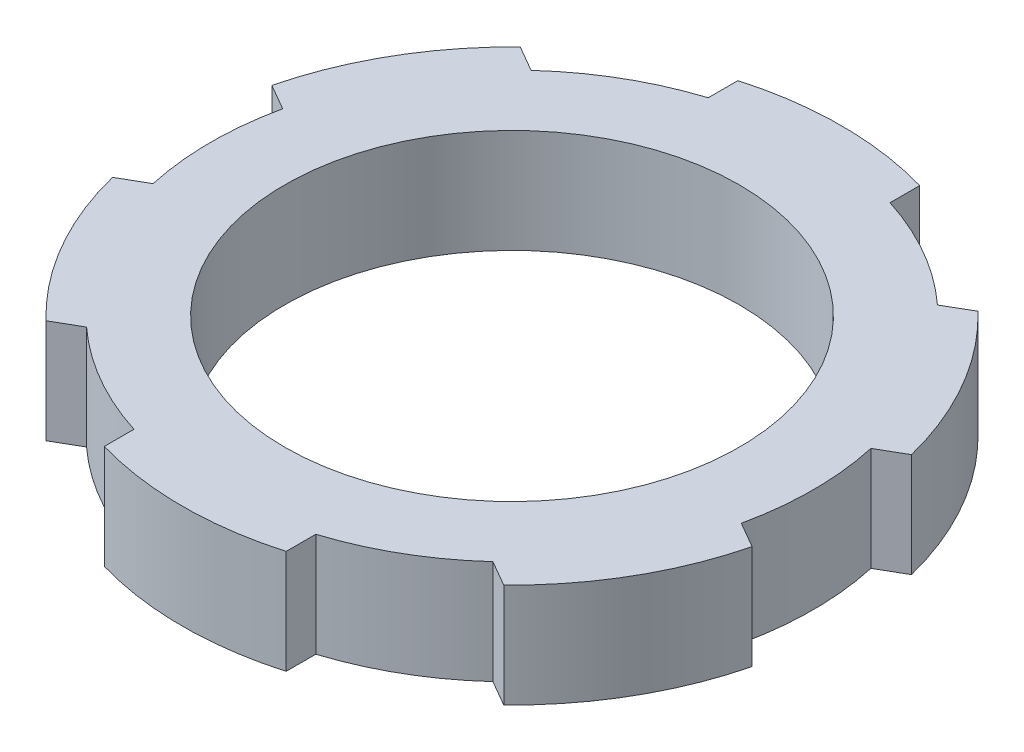
ISO-10303-21;
HEADER;
FILE_DESCRIPTION(('STEP AP214'),'2;1');
FILE_NAME('part.step','',(''),(''),'','','');
FILE_SCHEMA(('AUTOMOTIVE_DESIGN { 1 0 10303 214 1 1 1 1 }'));
ENDSEC;
DATA;
#1=APPLICATION_CONTEXT('core data for automotive mechanical design processes');
#2=APPLICATION_PROTOCOL_DEFINITION('international standard','automotive_design',2000,#1);
#3=PRODUCT_CONTEXT('',#1,'mechanical');
#4=PRODUCT('Part','Part','',(#3));
#5=PRODUCT_RELATED_PRODUCT_CATEGORY('part','',(#4));
#6=PRODUCT_DEFINITION_FORMATION('','',#4);
#7=PRODUCT_DEFINITION_CONTEXT('part definition',#1,'design');
#8=PRODUCT_DEFINITION('design','',#6,#7);
#9=PRODUCT_DEFINITION_SHAPE('','',#8);
#10=(LENGTH_UNIT() NAMED_UNIT(*) SI_UNIT(.MILLI.,.METRE.));
#11=(NAMED_UNIT(*) PLANE_ANGLE_UNIT() SI_UNIT($,.RADIAN.));
#12=(NAMED_UNIT(*) SI_UNIT($,.STERADIAN.) SOLID_ANGLE_UNIT());
#13=UNCERTAINTY_MEASURE_WITH_UNIT(LENGTH_MEASURE(1.E-05),#10,'distance_accuracy_value','');
#14=(GEOMETRIC_REPRESENTATION_CONTEXT(3) GLOBAL_UNCERTAINTY_ASSIGNED_CONTEXT((#13)) GLOBAL_UNIT_ASSIGNED_CONTEXT((#10,
#11,#12)) REPRESENTATION_CONTEXT('',''));
#15=CARTESIAN_POINT('',(0.,0.,0.));
#16=DIRECTION('',(0.,0.,1.));
#17=DIRECTION('',(1.,0.,0.));
#18=AXIS2_PLACEMENT_3D('',#15,#16,#17);
#19=CARTESIAN_POINT('',(0.,4.57199999999999,0.));
#20=DIRECTION('',(0.,-1.,0.));
#21=DIRECTION('',(0.,0.,-1.00000000000002));
#22=AXIS2_PLACEMENT_3D('',#19,#20,#21);
#23=CYLINDRICAL_SURFACE('',#22,13.25);
#24=CARTESIAN_POINT('',(0.,4.57199999999999,0.));
#25=DIRECTION('',(0.,1.,0.));
#26=DIRECTION('',(0.,0.,1.00000000000002));
#27=AXIS2_PLACEMENT_3D('',#24,#25,#26);
#28=CIRCLE('',#27,13.25);
#29=CARTESIAN_POINT('',(8.93946410936116,4.57199999999999,-9.78000416346832));
#30=VERTEX_POINT('',#29);
#31=CARTESIAN_POINT('',(4.,4.57199999999999,-12.6318050966598));
#32=VERTEX_POINT('',#31);
#33=EDGE_CURVE('E54',#30,#32,#28,.T.);
#34=ORIENTED_EDGE('',*,*,#33,.F.);
#35=DIRECTION('',(0.,1.,0.));
#36=VECTOR('',#35,1.);
#37=CARTESIAN_POINT('',(8.93946410936116,-9.15394837083547,-9.78000416346832));
#38=LINE('',#37,#36);
#39=CARTESIAN_POINT('',(8.93946410936116,0.,-9.78000416346832));
#40=VERTEX_POINT('',#39);
#41=EDGE_CURVE('E238',#40,#30,#38,.T.);
#42=ORIENTED_EDGE('',*,*,#41,.F.);
#43=CARTESIAN_POINT('',(0.,0.,0.));
#44=DIRECTION('',(0.,1.,0.));
#45=DIRECTION('',(0.,0.,1.00000000000002));
#46=AXIS2_PLACEMENT_3D('',#43,#44,#45);
#47=CIRCLE('',#46,13.25);
#48=CARTESIAN_POINT('',(4.,0.,-12.6318050966598));
#49=VERTEX_POINT('',#48);
#50=EDGE_CURVE('E372',#40,#49,#47,.T.);
#51=ORIENTED_EDGE('',*,*,#50,.T.);
#52=DIRECTION('',(0.,1.,0.));
#53=VECTOR('',#52,1.);
#54=CARTESIAN_POINT('',(4.,-8.21523902250362,-12.6318050966598));
#55=LINE('',#54,#53);
#56=EDGE_CURVE('E358',#49,#32,#55,.T.);
#57=ORIENTED_EDGE('',*,*,#56,.T.);
#58=EDGE_LOOP('',(#34,#42,#51,#57));
#59=FACE_BOUND('',#58,.T.);
#60=ADVANCED_FACE('F44',(#59),#23,.T.);
#61=CARTESIAN_POINT('',(12.9394641093614,0.,2.85180093319191));
#62=VERTEX_POINT('',#61);
#63=CARTESIAN_POINT('',(12.9394641093613,0.,-2.8518009331929));
#64=VERTEX_POINT('',#63);
#65=EDGE_CURVE('E406',#62,#64,#47,.T.);
#66=ORIENTED_EDGE('',*,*,#65,.T.);
#67=DIRECTION('',(0.,1.,0.));
#68=VECTOR('',#67,1.);
#69=CARTESIAN_POINT('',(12.9394641093613,-9.15394837083547,-2.8518009331929));
#70=LINE('',#69,#68);
#71=CARTESIAN_POINT('',(12.9394641093613,4.57199999999999,-2.8518009331929));
#72=VERTEX_POINT('',#71);
#73=EDGE_CURVE('E68',#64,#72,#70,.T.);
#74=ORIENTED_EDGE('',*,*,#73,.T.);
#75=CARTESIAN_POINT('',(12.9394641093614,4.57199999999999,2.85180093319191));
#76=VERTEX_POINT('',#75);
#77=EDGE_CURVE('E231',#76,#72,#28,.T.);
#78=ORIENTED_EDGE('',*,*,#77,.F.);
#79=DIRECTION('',(0.,1.,0.));
#80=VECTOR('',#79,1.);
#81=CARTESIAN_POINT('',(12.9394641093614,-9.15394837083544,2.85180093319191));
#82=LINE('',#81,#80);
#83=EDGE_CURVE('E248',#62,#76,#82,.T.);
#84=ORIENTED_EDGE('',*,*,#83,.F.);
#85=EDGE_LOOP('',(#66,#74,#78,#84));
#86=FACE_BOUND('',#85,.T.);
#87=ADVANCED_FACE('F395',(#86),#23,.T.);
#88=CARTESIAN_POINT('',(4.00000000000005,0.,12.6318050966592));
#89=VERTEX_POINT('',#88);
#90=CARTESIAN_POINT('',(8.93946410936135,0.,9.78000416346757));
#91=VERTEX_POINT('',#90);
#92=EDGE_CURVE('E409',#89,#91,#47,.T.);
#93=ORIENTED_EDGE('',*,*,#92,.T.);
#94=DIRECTION('',(0.,1.,0.));
#95=VECTOR('',#94,1.);
#96=CARTESIAN_POINT('',(8.93946410936135,-9.15394837083544,9.78000416346757));
#97=LINE('',#96,#95);
#98=CARTESIAN_POINT('',(8.93946410936135,4.57199999999999,9.78000416346757));
#99=VERTEX_POINT('',#98);
#100=EDGE_CURVE('E258',#91,#99,#97,.T.);
#101=ORIENTED_EDGE('',*,*,#100,.T.);
#102=CARTESIAN_POINT('',(4.00000000000005,4.57199999999999,12.6318050966592));
#103=VERTEX_POINT('',#102);
#104=EDGE_CURVE('E449',#103,#99,#28,.T.);
#105=ORIENTED_EDGE('',*,*,#104,.F.);
#106=DIRECTION('',(0.,1.,0.));
#107=VECTOR('',#106,1.);
#108=CARTESIAN_POINT('',(4.00000000000005,-8.21523902250362,12.6318050966592));
#109=LINE('',#108,#107);
#110=EDGE_CURVE('E272',#89,#103,#109,.T.);
#111=ORIENTED_EDGE('',*,*,#110,.F.);
#112=EDGE_LOOP('',(#93,#101,#105,#111));
#113=FACE_BOUND('',#112,.T.);
#114=ADVANCED_FACE('F399',(#113),#23,.T.);
#115=CARTESIAN_POINT('',(-8.93946410936122,0.,9.78000416346746));
#116=VERTEX_POINT('',#115);
#117=CARTESIAN_POINT('',(-4.00000000000007,0.,12.6318050966598));
#118=VERTEX_POINT('',#117);
#119=EDGE_CURVE('E470',#116,#118,#47,.T.);
#120=ORIENTED_EDGE('',*,*,#119,.T.);
#121=DIRECTION('',(0.,1.,0.));
#122=VECTOR('',#121,1.);
#123=CARTESIAN_POINT('',(-4.00000000000007,-8.21523902250362,12.6318050966598));
#124=LINE('',#123,#122);
#125=CARTESIAN_POINT('',(-4.00000000000007,4.57199999999999,12.6318050966598));
#126=VERTEX_POINT('',#125);
#127=EDGE_CURVE('E283',#118,#126,#124,.T.);
#128=ORIENTED_EDGE('',*,*,#127,.T.);
#129=CARTESIAN_POINT('',(-8.93946410936122,4.57199999999999,9.78000416346746));
#130=VERTEX_POINT('',#129);
#131=EDGE_CURVE('E447',#130,#126,#28,.T.);
#132=ORIENTED_EDGE('',*,*,#131,.F.);
#133=DIRECTION('',(0.,1.,0.));
#134=VECTOR('',#133,1.);
#135=CARTESIAN_POINT('',(-8.93946410936122,-9.15394837083547,9.78000416346746));
#136=LINE('',#135,#134);
#137=EDGE_CURVE('E297',#116,#130,#136,.T.);
#138=ORIENTED_EDGE('',*,*,#137,.F.);
#139=EDGE_LOOP('',(#120,#128,#132,#138));
#140=FACE_BOUND('',#139,.T.);
#141=ADVANCED_FACE('F403',(#140),#23,.T.);
#142=CARTESIAN_POINT('',(-12.9394641093614,0.,-2.8518009331925));
#143=VERTEX_POINT('',#142);
#144=CARTESIAN_POINT('',(-12.9394641093614,0.,2.85180093319182));
#145=VERTEX_POINT('',#144);
#146=EDGE_CURVE('E444',#143,#145,#47,.T.);
#147=ORIENTED_EDGE('',*,*,#146,.T.);
#148=DIRECTION('',(0.,1.,0.));
#149=VECTOR('',#148,1.);
#150=CARTESIAN_POINT('',(-12.9394641093614,-9.15394837083547,2.85180093319186));
#151=LINE('',#150,#149);
#152=CARTESIAN_POINT('',(-12.9394641093614,4.57199999999999,2.85180093319182));
#153=VERTEX_POINT('',#152);
#154=EDGE_CURVE('E308',#145,#153,#151,.T.);
#155=ORIENTED_EDGE('',*,*,#154,.T.);
#156=CARTESIAN_POINT('',(-12.9394641093613,4.57199999999999,-2.85180093319252));
#157=VERTEX_POINT('',#156);
#158=EDGE_CURVE('E53',#157,#153,#28,.T.);
#159=ORIENTED_EDGE('',*,*,#158,.F.);
#160=DIRECTION('',(0.,1.,0.));
#161=VECTOR('',#160,1.);
#162=CARTESIAN_POINT('',(-12.9394641093614,-9.15394837083544,-2.8518009331925));
#163=LINE('',#162,#161);
#164=EDGE_CURVE('E322',#143,#157,#163,.T.);
#165=ORIENTED_EDGE('',*,*,#164,.F.);
#166=EDGE_LOOP('',(#147,#155,#159,#165));
#167=FACE_BOUND('',#166,.T.);
#168=ADVANCED_FACE('F391',(#167),#23,.T.);
#169=CARTESIAN_POINT('',(0.,4.57199999999999,0.));
#170=DIRECTION('',(0.,1.,0.));
#171=DIRECTION('',(0.,0.,1.00000000000002));
#172=AXIS2_PLACEMENT_3D('',#169,#170,#171);
#173=PLANE('',#172);
#174=CARTESIAN_POINT('',(-4.00000000000004,4.57199999999999,-12.6318050966608));
#175=VERTEX_POINT('',#174);
#176=CARTESIAN_POINT('',(-8.93946410936131,4.57199999999999,-9.78000416346794));
#177=VERTEX_POINT('',#176);
#178=EDGE_CURVE('E13',#175,#177,#28,.T.);
#179=ORIENTED_EDGE('',*,*,#178,.T.);
#180=DIRECTION('',(-0.866025403784457,0.,-0.500000000000007));
#181=VECTOR('',#180,1.);
#182=CARTESIAN_POINT('',(-10.0701077045735,4.57199999999999,-10.4327815475213));
#183=LINE('',#182,#181);
#184=CARTESIAN_POINT('',(-10.0701077045735,4.57199999999999,-10.4327815475214));
#185=VERTEX_POINT('',#184);
#186=EDGE_CURVE('E318',#177,#185,#183,.T.);
#187=ORIENTED_EDGE('',*,*,#186,.T.);
#188=CARTESIAN_POINT('',(0.,4.57199999999999,0.));
#189=DIRECTION('',(0.,1.,0.));
#190=DIRECTION('',(0.866025403784457,0.,0.500000000000007));
#191=AXIS2_PLACEMENT_3D('',#188,#189,#190);
#192=CIRCLE('',#191,14.5);
#193=CARTESIAN_POINT('',(-14.0701077045736,4.57199999999999,-3.50457831724586));
#194=VERTEX_POINT('',#193);
#195=EDGE_CURVE('E327',#185,#194,#192,.T.);
#196=ORIENTED_EDGE('',*,*,#195,.T.);
#197=DIRECTION('',(0.866025403784457,0.,0.500000000000007));
#198=VECTOR('',#197,1.);
#199=CARTESIAN_POINT('',(-12.9394641093614,4.57199999999999,-2.8518009331925));
#200=LINE('',#199,#198);
#201=EDGE_CURVE('E330',#194,#157,#200,.T.);
#202=ORIENTED_EDGE('',*,*,#201,.T.);
#203=ORIENTED_EDGE('',*,*,#158,.T.);
#204=DIRECTION('',(-0.866025403784455,0.,0.500000000000013));
#205=VECTOR('',#204,1.);
#206=CARTESIAN_POINT('',(-14.0701077045736,4.57199999999999,3.50457831724542));
#207=LINE('',#206,#205);
#208=CARTESIAN_POINT('',(-14.0701077045736,4.57199999999999,3.50457831724542));
#209=VERTEX_POINT('',#208);
#210=EDGE_CURVE('E293',#153,#209,#207,.T.);
#211=ORIENTED_EDGE('',*,*,#210,.T.);
#212=CARTESIAN_POINT('',(0.,4.57199999999999,0.));
#213=DIRECTION('',(0.,1.,0.));
#214=DIRECTION('',(0.866025403784455,0.,-0.500000000000013));
#215=AXIS2_PLACEMENT_3D('',#212,#213,#214);
#216=CIRCLE('',#215,14.5);
#217=CARTESIAN_POINT('',(-10.0701077045734,4.57199999999999,10.4327815475208));
#218=VERTEX_POINT('',#217);
#219=EDGE_CURVE('E302',#209,#218,#216,.T.);
#220=ORIENTED_EDGE('',*,*,#219,.T.);
#221=DIRECTION('',(0.866025403784455,0.,-0.500000000000013));
#222=VECTOR('',#221,1.);
#223=CARTESIAN_POINT('',(-8.93946410936122,4.57199999999999,9.78000416346746));
#224=LINE('',#223,#222);
#225=EDGE_CURVE('E305',#218,#130,#224,.T.);
#226=ORIENTED_EDGE('',*,*,#225,.T.);
#227=ORIENTED_EDGE('',*,*,#131,.T.);
#228=DIRECTION('',(0.,0.,1.00000000000002));
#229=VECTOR('',#228,1.);
#230=CARTESIAN_POINT('',(-4.00000000000007,4.57199999999999,13.9373598647661));
#231=LINE('',#230,#229);
#232=CARTESIAN_POINT('',(-4.00000000000007,4.57199999999999,13.9373598647661));
#233=VERTEX_POINT('',#232);
#234=EDGE_CURVE('E268',#126,#233,#231,.T.);
#235=ORIENTED_EDGE('',*,*,#234,.T.);
#236=CARTESIAN_POINT('',(0.,4.57199999999999,0.));
#237=DIRECTION('',(0.,1.,0.));
#238=DIRECTION('',(0.,0.,-1.00000000000002));
#239=AXIS2_PLACEMENT_3D('',#236,#237,#238);
#240=CIRCLE('',#239,14.5);
#241=CARTESIAN_POINT('',(4.00000000000007,4.57199999999999,13.9373598647664));
#242=VERTEX_POINT('',#241);
#243=EDGE_CURVE('E277',#233,#242,#240,.T.);
#244=ORIENTED_EDGE('',*,*,#243,.T.);
#245=DIRECTION('',(0.,0.,-1.00000000000002));
#246=VECTOR('',#245,1.);
#247=CARTESIAN_POINT('',(4.00000000000005,4.57199999999999,12.6318050966592));
#248=LINE('',#247,#246);
#249=EDGE_CURVE('E280',#242,#103,#248,.T.);
#250=ORIENTED_EDGE('',*,*,#249,.T.);
#251=ORIENTED_EDGE('',*,*,#104,.T.);
#252=DIRECTION('',(0.86602540378446,0.,0.5));
#253=VECTOR('',#252,1.);
#254=CARTESIAN_POINT('',(10.0701077045736,4.57199999999999,10.4327815475209));
#255=LINE('',#254,#253);
#256=CARTESIAN_POINT('',(10.0701077045737,4.57199999999999,10.4327815475208));
#257=VERTEX_POINT('',#256);
#258=EDGE_CURVE('E244',#99,#257,#255,.T.);
#259=ORIENTED_EDGE('',*,*,#258,.T.);
#260=CARTESIAN_POINT('',(0.,4.57199999999999,0.));
#261=DIRECTION('',(0.,1.,0.));
#262=DIRECTION('',(-0.86602540378446,0.,-0.5));
#263=AXIS2_PLACEMENT_3D('',#260,#261,#262);
#264=CIRCLE('',#263,14.5);
#265=CARTESIAN_POINT('',(14.0701077045736,4.57199999999999,3.504578317245));
#266=VERTEX_POINT('',#265);
#267=EDGE_CURVE('E253',#257,#266,#264,.T.);
#268=ORIENTED_EDGE('',*,*,#267,.T.);
#269=DIRECTION('',(-0.86602540378446,0.,-0.5));
#270=VECTOR('',#269,1.);
#271=CARTESIAN_POINT('',(12.9394641093614,4.57199999999999,2.85180093319191));
#272=LINE('',#271,#270);
#273=EDGE_CURVE('E256',#266,#76,#272,.T.);
#274=ORIENTED_EDGE('',*,*,#273,.T.);
#275=ORIENTED_EDGE('',*,*,#77,.T.);
#276=DIRECTION('',(0.866025403784451,0.,-0.50000000000002));
#277=VECTOR('',#276,1.);
#278=CARTESIAN_POINT('',(14.0701077045735,4.57199999999999,-3.50457831724599));
#279=LINE('',#278,#277);
#280=CARTESIAN_POINT('',(14.0701077045735,4.57199999999999,-3.504578317246));
#281=VERTEX_POINT('',#280);
#282=EDGE_CURVE('E212',#72,#281,#279,.T.);
#283=ORIENTED_EDGE('',*,*,#282,.T.);
#284=CARTESIAN_POINT('',(0.,4.57199999999999,0.));
#285=DIRECTION('',(0.,1.,0.));
#286=DIRECTION('',(-0.866025403784451,0.,0.50000000000002));
#287=AXIS2_PLACEMENT_3D('',#284,#285,#286);
#288=CIRCLE('',#287,14.5);
#289=CARTESIAN_POINT('',(10.0701077045733,4.57199999999999,-10.4327815475215));
#290=VERTEX_POINT('',#289);
#291=EDGE_CURVE('E220',#281,#290,#288,.T.);
#292=ORIENTED_EDGE('',*,*,#291,.T.);
#293=DIRECTION('',(-0.866025403784451,0.,0.50000000000002));
#294=VECTOR('',#293,1.);
#295=CARTESIAN_POINT('',(8.93946410936116,4.57199999999999,-9.78000416346832));
#296=LINE('',#295,#294);
#297=EDGE_CURVE('E226',#290,#30,#296,.T.);
#298=ORIENTED_EDGE('',*,*,#297,.T.);
#299=ORIENTED_EDGE('',*,*,#33,.T.);
#300=DIRECTION('',(0.,0.,-1.00000000000002));
#301=VECTOR('',#300,1.);
#302=CARTESIAN_POINT('',(4.0000000000001,4.57199999999999,-13.9373598647666));
#303=LINE('',#302,#301);
#304=CARTESIAN_POINT('',(4.0000000000001,4.57199999999999,-13.9373598647666));
#305=VERTEX_POINT('',#304);
#306=EDGE_CURVE('E343',#32,#305,#303,.T.);
#307=ORIENTED_EDGE('',*,*,#306,.T.);
#308=CARTESIAN_POINT('',(0.,4.57199999999999,0.));
#309=DIRECTION('',(0.,1.,0.));
#310=DIRECTION('',(0.,0.,1.00000000000002));
#311=AXIS2_PLACEMENT_3D('',#308,#309,#310);
#312=CIRCLE('',#311,14.5);
#313=CARTESIAN_POINT('',(-4.00000000000006,4.57199999999999,-13.9373598647675));
#314=VERTEX_POINT('',#313);
#315=EDGE_CURVE('E352',#305,#314,#312,.T.);
#316=ORIENTED_EDGE('',*,*,#315,.T.);
#317=DIRECTION('',(0.,0.,1.00000000000002));
#318=VECTOR('',#317,1.);
#319=CARTESIAN_POINT('',(-4.00000000000004,4.57199999999999,-12.6318050966608));
#320=LINE('',#319,#318);
#321=EDGE_CURVE('E355',#314,#175,#320,.T.);
#322=ORIENTED_EDGE('',*,*,#321,.T.);
#323=EDGE_LOOP('',(#179,#187,#196,#202,#203,#211,#220,#226,#227,#235,#244,#250,#251,#259,#268,
#274,#275,#283,#292,#298,#299,#307,#316,#322));
#324=FACE_BOUND('',#323,.T.);
#325=CARTESIAN_POINT('',(0.,4.57199999999999,0.));
#326=DIRECTION('',(0.,1.,0.));
#327=DIRECTION('',(0.,0.,1.00000000000002));
#328=AXIS2_PLACEMENT_3D('',#325,#326,#327);
#329=CIRCLE('',#328,10.);
#330=CARTESIAN_POINT('',(0.,4.57199999999999,10.0000000000002));
#331=VERTEX_POINT('',#330);
#332=EDGE_CURVE('E369',#331,#331,#329,.T.);
#333=ORIENTED_EDGE('',*,*,#332,.F.);
#334=EDGE_LOOP('',(#333));
#335=FACE_BOUND('',#334,.T.);
#336=ADVANCED_FACE('F228',(#324,#335),#173,.T.);
#337=CARTESIAN_POINT('',(0.,0.,0.));
#338=DIRECTION('',(0.,1.,0.));
#339=DIRECTION('',(0.,0.,1.00000000000002));
#340=AXIS2_PLACEMENT_3D('',#337,#338,#339);
#341=PLANE('',#340);
#342=CARTESIAN_POINT('',(-4.00000000000004,0.,-12.6318050966608));
#343=VERTEX_POINT('',#342);
#344=CARTESIAN_POINT('',(-8.93946410936131,0.,-9.78000416346794));
#345=VERTEX_POINT('',#344);
#346=EDGE_CURVE('E48',#343,#345,#47,.T.);
#347=ORIENTED_EDGE('',*,*,#346,.F.);
#348=DIRECTION('',(0.,0.,-1.00000000000002));
#349=VECTOR('',#348,1.);
#350=CARTESIAN_POINT('',(-4.00000000000004,0.,-12.6318050966608));
#351=LINE('',#350,#349);
#352=CARTESIAN_POINT('',(-4.00000000000006,0.,-13.9373598647675));
#353=VERTEX_POINT('',#352);
#354=EDGE_CURVE('E346',#343,#353,#351,.T.);
#355=ORIENTED_EDGE('',*,*,#354,.T.);
#356=CARTESIAN_POINT('',(0.,0.,0.));
#357=DIRECTION('',(0.,1.,0.));
#358=DIRECTION('',(0.,0.,1.00000000000002));
#359=AXIS2_PLACEMENT_3D('',#356,#357,#358);
#360=CIRCLE('',#359,14.5);
#361=CARTESIAN_POINT('',(4.0000000000001,0.,-13.9373598647666));
#362=VERTEX_POINT('',#361);
#363=EDGE_CURVE('E344',#353,#362,#360,.F.);
#364=ORIENTED_EDGE('',*,*,#363,.T.);
#365=DIRECTION('',(0.,0.,1.00000000000002));
#366=VECTOR('',#365,1.);
#367=CARTESIAN_POINT('',(4.0000000000001,0.,-13.9373598647666));
#368=LINE('',#367,#366);
#369=EDGE_CURVE('E349',#362,#49,#368,.T.);
#370=ORIENTED_EDGE('',*,*,#369,.T.);
#371=ORIENTED_EDGE('',*,*,#50,.F.);
#372=DIRECTION('',(0.866025403784451,0.,-0.50000000000002));
#373=VECTOR('',#372,1.);
#374=CARTESIAN_POINT('',(8.93946410936116,0.,-9.78000416346832));
#375=LINE('',#374,#373);
#376=CARTESIAN_POINT('',(10.0701077045733,0.,-10.4327815475215));
#377=VERTEX_POINT('',#376);
#378=EDGE_CURVE('E234',#40,#377,#375,.T.);
#379=ORIENTED_EDGE('',*,*,#378,.T.);
#380=CARTESIAN_POINT('',(0.,0.,0.));
#381=DIRECTION('',(0.,1.,0.));
#382=DIRECTION('',(0.,0.,1.00000000000002));
#383=AXIS2_PLACEMENT_3D('',#380,#381,#382);
#384=CIRCLE('',#383,14.5);
#385=CARTESIAN_POINT('',(14.0701077045735,0.,-3.504578317246));
#386=VERTEX_POINT('',#385);
#387=EDGE_CURVE('E240',#377,#386,#384,.F.);
#388=ORIENTED_EDGE('',*,*,#387,.T.);
#389=DIRECTION('',(-0.866025403784451,0.,0.50000000000002));
#390=VECTOR('',#389,1.);
#391=CARTESIAN_POINT('',(14.0701077045735,0.,-3.50457831724599));
#392=LINE('',#391,#390);
#393=EDGE_CURVE('E214',#386,#64,#392,.T.);
#394=ORIENTED_EDGE('',*,*,#393,.T.);
#395=ORIENTED_EDGE('',*,*,#65,.F.);
#396=DIRECTION('',(0.86602540378446,0.,0.500000000000001));
#397=VECTOR('',#396,1.);
#398=CARTESIAN_POINT('',(12.9394641093614,0.,2.85180093319191));
#399=LINE('',#398,#397);
#400=CARTESIAN_POINT('',(14.0701077045736,0.,3.504578317245));
#401=VERTEX_POINT('',#400);
#402=EDGE_CURVE('E247',#62,#401,#399,.T.);
#403=ORIENTED_EDGE('',*,*,#402,.T.);
#404=CARTESIAN_POINT('',(0.,0.,0.));
#405=DIRECTION('',(0.,1.,0.));
#406=DIRECTION('',(0.,0.,1.00000000000002));
#407=AXIS2_PLACEMENT_3D('',#404,#405,#406);
#408=CIRCLE('',#407,14.5);
#409=CARTESIAN_POINT('',(10.0701077045737,0.,10.4327815475208));
#410=VERTEX_POINT('',#409);
#411=EDGE_CURVE('E245',#401,#410,#408,.F.);
#412=ORIENTED_EDGE('',*,*,#411,.T.);
#413=DIRECTION('',(-0.86602540378446,0.,-0.500000000000001));
#414=VECTOR('',#413,1.);
#415=CARTESIAN_POINT('',(10.0701077045736,0.,10.4327815475209));
#416=LINE('',#415,#414);
#417=EDGE_CURVE('E250',#410,#91,#416,.T.);
#418=ORIENTED_EDGE('',*,*,#417,.T.);
#419=ORIENTED_EDGE('',*,*,#92,.F.);
#420=DIRECTION('',(0.,0.,1.00000000000002));
#421=VECTOR('',#420,1.);
#422=CARTESIAN_POINT('',(4.00000000000005,0.,12.6318050966592));
#423=LINE('',#422,#421);
#424=CARTESIAN_POINT('',(4.00000000000007,0.,13.9373598647664));
#425=VERTEX_POINT('',#424);
#426=EDGE_CURVE('E271',#89,#425,#423,.T.);
#427=ORIENTED_EDGE('',*,*,#426,.T.);
#428=CARTESIAN_POINT('',(0.,0.,0.));
#429=DIRECTION('',(0.,1.,0.));
#430=DIRECTION('',(0.,0.,1.00000000000002));
#431=AXIS2_PLACEMENT_3D('',#428,#429,#430);
#432=CIRCLE('',#431,14.5);
#433=CARTESIAN_POINT('',(-4.00000000000007,0.,13.9373598647661));
#434=VERTEX_POINT('',#433);
#435=EDGE_CURVE('E269',#425,#434,#432,.F.);
#436=ORIENTED_EDGE('',*,*,#435,.T.);
#437=DIRECTION('',(0.,0.,-1.00000000000002));
#438=VECTOR('',#437,1.);
#439=CARTESIAN_POINT('',(-4.00000000000007,0.,13.9373598647661));
#440=LINE('',#439,#438);
#441=EDGE_CURVE('E274',#434,#118,#440,.T.);
#442=ORIENTED_EDGE('',*,*,#441,.T.);
#443=ORIENTED_EDGE('',*,*,#119,.F.);
#444=DIRECTION('',(-0.866025403784455,0.,0.500000000000013));
#445=VECTOR('',#444,1.);
#446=CARTESIAN_POINT('',(-8.93946410936122,0.,9.78000416346746));
#447=LINE('',#446,#445);
#448=CARTESIAN_POINT('',(-10.0701077045734,0.,10.4327815475208));
#449=VERTEX_POINT('',#448);
#450=EDGE_CURVE('E296',#116,#449,#447,.T.);
#451=ORIENTED_EDGE('',*,*,#450,.T.);
#452=CARTESIAN_POINT('',(0.,0.,0.));
#453=DIRECTION('',(0.,1.,0.));
#454=DIRECTION('',(0.,0.,1.00000000000002));
#455=AXIS2_PLACEMENT_3D('',#452,#453,#454);
#456=CIRCLE('',#455,14.5);
#457=CARTESIAN_POINT('',(-14.0701077045736,0.,3.50457831724542));
#458=VERTEX_POINT('',#457);
#459=EDGE_CURVE('E294',#449,#458,#456,.F.);
#460=ORIENTED_EDGE('',*,*,#459,.T.);
#461=DIRECTION('',(0.866025403784455,0.,-0.500000000000013));
#462=VECTOR('',#461,1.);
#463=CARTESIAN_POINT('',(-14.0701077045736,0.,3.50457831724542));
#464=LINE('',#463,#462);
#465=EDGE_CURVE('E299',#458,#145,#464,.T.);
#466=ORIENTED_EDGE('',*,*,#465,.T.);
#467=ORIENTED_EDGE('',*,*,#146,.F.);
#468=DIRECTION('',(-0.866025403784458,0.,-0.500000000000007));
#469=VECTOR('',#468,1.);
#470=CARTESIAN_POINT('',(-12.9394641093614,0.,-2.8518009331925));
#471=LINE('',#470,#469);
#472=CARTESIAN_POINT('',(-14.0701077045736,0.,-3.50457831724586));
#473=VERTEX_POINT('',#472);
#474=EDGE_CURVE('E321',#143,#473,#471,.T.);
#475=ORIENTED_EDGE('',*,*,#474,.T.);
#476=CARTESIAN_POINT('',(0.,0.,0.));
#477=DIRECTION('',(0.,1.,0.));
#478=DIRECTION('',(0.,0.,1.00000000000002));
#479=AXIS2_PLACEMENT_3D('',#476,#477,#478);
#480=CIRCLE('',#479,14.5);
#481=CARTESIAN_POINT('',(-10.0701077045735,0.,-10.4327815475214));
#482=VERTEX_POINT('',#481);
#483=EDGE_CURVE('E319',#473,#482,#480,.F.);
#484=ORIENTED_EDGE('',*,*,#483,.T.);
#485=DIRECTION('',(0.866025403784458,0.,0.500000000000007));
#486=VECTOR('',#485,1.);
#487=CARTESIAN_POINT('',(-10.0701077045735,0.,-10.4327815475213));
#488=LINE('',#487,#486);
#489=EDGE_CURVE('E324',#482,#345,#488,.T.);
#490=ORIENTED_EDGE('',*,*,#489,.T.);
#491=EDGE_LOOP('',(#347,#355,#364,#370,#371,#379,#388,#394,#395,#403,#412,#418,#419,#427,#436,
#442,#443,#451,#460,#466,#467,#475,#484,#490));
#492=FACE_BOUND('',#491,.T.);
#493=CARTESIAN_POINT('',(0.,0.,0.));
#494=DIRECTION('',(0.,1.,0.));
#495=DIRECTION('',(0.,0.,1.00000000000002));
#496=AXIS2_PLACEMENT_3D('',#493,#494,#495);
#497=CIRCLE('',#496,10.);
#498=CARTESIAN_POINT('',(0.,0.,10.0000000000002));
#499=VERTEX_POINT('',#498);
#500=EDGE_CURVE('E368',#499,#499,#497,.T.);
#501=ORIENTED_EDGE('',*,*,#500,.T.);
#502=EDGE_LOOP('',(#501));
#503=FACE_BOUND('',#502,.T.);
#504=ADVANCED_FACE('F376',(#492,#503),#341,.F.);
#505=ORIENTED_EDGE('',*,*,#346,.T.);
#506=DIRECTION('',(0.,1.,0.));
#507=VECTOR('',#506,1.);
#508=CARTESIAN_POINT('',(-8.93946410936131,-9.15394837083544,-9.78000416346794));
#509=LINE('',#508,#507);
#510=EDGE_CURVE('E333',#345,#177,#509,.T.);
#511=ORIENTED_EDGE('',*,*,#510,.T.);
#512=ORIENTED_EDGE('',*,*,#178,.F.);
#513=DIRECTION('',(0.,1.,0.));
#514=VECTOR('',#513,1.);
#515=CARTESIAN_POINT('',(-4.00000000000004,-8.21523902250362,-12.6318050966608));
#516=LINE('',#515,#514);
#517=EDGE_CURVE('E347',#343,#175,#516,.T.);
#518=ORIENTED_EDGE('',*,*,#517,.F.);
#519=EDGE_LOOP('',(#505,#511,#512,#518));
#520=FACE_BOUND('',#519,.T.);
#521=ADVANCED_FACE('F46',(#520),#23,.T.);
#522=CARTESIAN_POINT('',(0.,4.57199999999999,0.));
#523=DIRECTION('',(0.,-1.,0.));
#524=DIRECTION('',(0.,0.,-1.00000000000002));
#525=AXIS2_PLACEMENT_3D('',#522,#523,#524);
#526=CYLINDRICAL_SURFACE('',#525,10.);
#527=ORIENTED_EDGE('',*,*,#332,.T.);
#528=EDGE_LOOP('',(#527));
#529=FACE_BOUND('',#528,.T.);
#530=ORIENTED_EDGE('',*,*,#500,.F.);
#531=EDGE_LOOP('',(#530));
#532=FACE_BOUND('',#531,.T.);
#533=ADVANCED_FACE('F378',(#529,#532),#526,.F.);
#534=CARTESIAN_POINT('',(-4.00000000000004,-8.21523902250362,-12.6318050966608));
#535=DIRECTION('',(-1.00000000000002,0.,0.));
#536=DIRECTION('',(0.,0.,1.00000000000002));
#537=AXIS2_PLACEMENT_3D('',#534,#535,#536);
#538=PLANE('',#537);
#539=ORIENTED_EDGE('',*,*,#354,.F.);
#540=ORIENTED_EDGE('',*,*,#517,.T.);
#541=ORIENTED_EDGE('',*,*,#321,.F.);
#542=DIRECTION('',(0.,1.,0.));
#543=VECTOR('',#542,1.);
#544=CARTESIAN_POINT('',(-4.00000000000006,-8.21523902250362,-13.9373598647675));
#545=LINE('',#544,#543);
#546=EDGE_CURVE('E361',#353,#314,#545,.T.);
#547=ORIENTED_EDGE('',*,*,#546,.F.);
#548=EDGE_LOOP('',(#539,#540,#541,#547));
#549=FACE_BOUND('',#548,.T.);
#550=ADVANCED_FACE('F380',(#549),#538,.T.);
#551=CARTESIAN_POINT('',(0.,-8.21523902250362,0.));
#552=DIRECTION('',(0.,1.,0.));
#553=DIRECTION('',(0.,0.,1.00000000000002));
#554=AXIS2_PLACEMENT_3D('',#551,#552,#553);
#555=CYLINDRICAL_SURFACE('',#554,14.5);
#556=ORIENTED_EDGE('',*,*,#363,.F.);
#557=ORIENTED_EDGE('',*,*,#546,.T.);
#558=ORIENTED_EDGE('',*,*,#315,.F.);
#559=DIRECTION('',(0.,1.,0.));
#560=VECTOR('',#559,1.);
#561=CARTESIAN_POINT('',(4.0000000000001,-8.21523902250362,-13.9373598647666));
#562=LINE('',#561,#560);
#563=EDGE_CURVE('E363',#362,#305,#562,.T.);
#564=ORIENTED_EDGE('',*,*,#563,.F.);
#565=EDGE_LOOP('',(#556,#557,#558,#564));
#566=FACE_BOUND('',#565,.T.);
#567=ADVANCED_FACE('F387',(#566),#555,.T.);
#568=CARTESIAN_POINT('',(4.0000000000001,-8.21523902250362,-13.9373598647666));
#569=DIRECTION('',(1.00000000000002,0.,0.));
#570=DIRECTION('',(0.,0.,-1.00000000000002));
#571=AXIS2_PLACEMENT_3D('',#568,#569,#570);
#572=PLANE('',#571);
#573=ORIENTED_EDGE('',*,*,#369,.F.);
#574=ORIENTED_EDGE('',*,*,#563,.T.);
#575=ORIENTED_EDGE('',*,*,#306,.F.);
#576=ORIENTED_EDGE('',*,*,#56,.F.);
#577=EDGE_LOOP('',(#573,#574,#575,#576));
#578=FACE_BOUND('',#577,.T.);
#579=ADVANCED_FACE('F417',(#578),#572,.T.);
#580=CARTESIAN_POINT('',(-12.9394641093614,-9.15394837083544,-2.8518009331925));
#581=DIRECTION('',(-0.500000000000007,0.,0.866025403784458));
#582=DIRECTION('',(0.866025403784458,0.,0.500000000000007));
#583=AXIS2_PLACEMENT_3D('',#580,#581,#582);
#584=PLANE('',#583);
#585=ORIENTED_EDGE('',*,*,#474,.F.);
#586=ORIENTED_EDGE('',*,*,#164,.T.);
#587=ORIENTED_EDGE('',*,*,#201,.F.);
#588=DIRECTION('',(0.,1.,0.));
#589=VECTOR('',#588,1.);
#590=CARTESIAN_POINT('',(-14.0701077045736,-9.15394837083544,-3.50457831724586));
#591=LINE('',#590,#589);
#592=EDGE_CURVE('E336',#473,#194,#591,.T.);
#593=ORIENTED_EDGE('',*,*,#592,.F.);
#594=EDGE_LOOP('',(#585,#586,#587,#593));
#595=FACE_BOUND('',#594,.T.);
#596=ADVANCED_FACE('F441',(#595),#584,.T.);
#597=CARTESIAN_POINT('',(0.,-9.15394837083544,0.));
#598=DIRECTION('',(0.,1.,0.));
#599=DIRECTION('',(0.,0.,1.00000000000002));
#600=AXIS2_PLACEMENT_3D('',#597,#598,#599);
#601=CYLINDRICAL_SURFACE('',#600,14.5);
#602=ORIENTED_EDGE('',*,*,#483,.F.);
#603=ORIENTED_EDGE('',*,*,#592,.T.);
#604=ORIENTED_EDGE('',*,*,#195,.F.);
#605=DIRECTION('',(0.,1.,0.));
#606=VECTOR('',#605,1.);
#607=CARTESIAN_POINT('',(-10.0701077045735,-9.15394837083544,-10.4327815475214));
#608=LINE('',#607,#606);
#609=EDGE_CURVE('E338',#482,#185,#608,.T.);
#610=ORIENTED_EDGE('',*,*,#609,.F.);
#611=EDGE_LOOP('',(#602,#603,#604,#610));
#612=FACE_BOUND('',#611,.T.);
#613=ADVANCED_FACE('F435',(#612),#601,.T.);
#614=CARTESIAN_POINT('',(-10.0701077045735,-9.15394837083544,-10.4327815475213));
#615=DIRECTION('',(0.500000000000007,0.,-0.866025403784458));
#616=DIRECTION('',(-0.866025403784458,0.,-0.500000000000007));
#617=AXIS2_PLACEMENT_3D('',#614,#615,#616);
#618=PLANE('',#617);
#619=ORIENTED_EDGE('',*,*,#489,.F.);
#620=ORIENTED_EDGE('',*,*,#609,.T.);
#621=ORIENTED_EDGE('',*,*,#186,.F.);
#622=ORIENTED_EDGE('',*,*,#510,.F.);
#623=EDGE_LOOP('',(#619,#620,#621,#622));
#624=FACE_BOUND('',#623,.T.);
#625=ADVANCED_FACE('F430',(#624),#618,.T.);
#626=CARTESIAN_POINT('',(-8.93946410936122,-9.15394837083547,9.78000416346746));
#627=DIRECTION('',(0.500000000000013,0.,0.866025403784454));
#628=DIRECTION('',(0.866025403784455,0.,-0.500000000000013));
#629=AXIS2_PLACEMENT_3D('',#626,#627,#628);
#630=PLANE('',#629);
#631=ORIENTED_EDGE('',*,*,#450,.F.);
#632=ORIENTED_EDGE('',*,*,#137,.T.);
#633=ORIENTED_EDGE('',*,*,#225,.F.);
#634=DIRECTION('',(0.,1.,0.));
#635=VECTOR('',#634,1.);
#636=CARTESIAN_POINT('',(-10.0701077045734,-9.15394837083547,10.4327815475208));
#637=LINE('',#636,#635);
#638=EDGE_CURVE('E311',#449,#218,#637,.T.);
#639=ORIENTED_EDGE('',*,*,#638,.F.);
#640=EDGE_LOOP('',(#631,#632,#633,#639));
#641=FACE_BOUND('',#640,.T.);
#642=ADVANCED_FACE('F489',(#641),#630,.T.);
#643=CARTESIAN_POINT('',(0.,-9.15394837083547,0.));
#644=DIRECTION('',(0.,1.,0.));
#645=DIRECTION('',(0.,0.,1.00000000000002));
#646=AXIS2_PLACEMENT_3D('',#643,#644,#645);
#647=CYLINDRICAL_SURFACE('',#646,14.5);
#648=ORIENTED_EDGE('',*,*,#459,.F.);
#649=ORIENTED_EDGE('',*,*,#638,.T.);
#650=ORIENTED_EDGE('',*,*,#219,.F.);
#651=DIRECTION('',(0.,1.,0.));
#652=VECTOR('',#651,1.);
#653=CARTESIAN_POINT('',(-14.0701077045736,-9.15394837083547,3.50457831724542));
#654=LINE('',#653,#652);
#655=EDGE_CURVE('E313',#458,#209,#654,.T.);
#656=ORIENTED_EDGE('',*,*,#655,.F.);
#657=EDGE_LOOP('',(#648,#649,#650,#656));
#658=FACE_BOUND('',#657,.T.);
#659=ADVANCED_FACE('F492',(#658),#647,.T.);
#660=CARTESIAN_POINT('',(-14.0701077045736,-9.15394837083547,3.50457831724542));
#661=DIRECTION('',(-0.500000000000013,0.,-0.866025403784454));
#662=DIRECTION('',(-0.866025403784455,0.,0.500000000000013));
#663=AXIS2_PLACEMENT_3D('',#660,#661,#662);
#664=PLANE('',#663);
#665=ORIENTED_EDGE('',*,*,#465,.F.);
#666=ORIENTED_EDGE('',*,*,#655,.T.);
#667=ORIENTED_EDGE('',*,*,#210,.F.);
#668=ORIENTED_EDGE('',*,*,#154,.F.);
#669=EDGE_LOOP('',(#665,#666,#667,#668));
#670=FACE_BOUND('',#669,.T.);
#671=ADVANCED_FACE('F496',(#670),#664,.T.);
#672=CARTESIAN_POINT('',(4.00000000000005,-8.21523902250362,12.6318050966592));
#673=DIRECTION('',(1.00000000000002,0.,0.));
#674=DIRECTION('',(0.,0.,-1.00000000000002));
#675=AXIS2_PLACEMENT_3D('',#672,#673,#674);
#676=PLANE('',#675);
#677=ORIENTED_EDGE('',*,*,#426,.F.);
#678=ORIENTED_EDGE('',*,*,#110,.T.);
#679=ORIENTED_EDGE('',*,*,#249,.F.);
#680=DIRECTION('',(0.,1.,0.));
#681=VECTOR('',#680,1.);
#682=CARTESIAN_POINT('',(4.00000000000007,-8.21523902250362,13.9373598647664));
#683=LINE('',#682,#681);
#684=EDGE_CURVE('E286',#425,#242,#683,.T.);
#685=ORIENTED_EDGE('',*,*,#684,.F.);
#686=EDGE_LOOP('',(#677,#678,#679,#685));
#687=FACE_BOUND('',#686,.T.);
#688=ADVANCED_FACE('F473',(#687),#676,.T.);
#689=CARTESIAN_POINT('',(0.,-8.21523902250362,0.));
#690=DIRECTION('',(0.,1.,0.));
#691=DIRECTION('',(0.,0.,1.00000000000002));
#692=AXIS2_PLACEMENT_3D('',#689,#690,#691);
#693=CYLINDRICAL_SURFACE('',#692,14.5);
#694=ORIENTED_EDGE('',*,*,#435,.F.);
#695=ORIENTED_EDGE('',*,*,#684,.T.);
#696=ORIENTED_EDGE('',*,*,#243,.F.);
#697=DIRECTION('',(0.,1.,0.));
#698=VECTOR('',#697,1.);
#699=CARTESIAN_POINT('',(-4.00000000000007,-8.21523902250362,13.9373598647661));
#700=LINE('',#699,#698);
#701=EDGE_CURVE('E288',#434,#233,#700,.T.);
#702=ORIENTED_EDGE('',*,*,#701,.F.);
#703=EDGE_LOOP('',(#694,#695,#696,#702));
#704=FACE_BOUND('',#703,.T.);
#705=ADVANCED_FACE('F476',(#704),#693,.T.);
#706=CARTESIAN_POINT('',(-4.00000000000007,-8.21523902250362,13.9373598647661));
#707=DIRECTION('',(-1.00000000000002,0.,0.));
#708=DIRECTION('',(0.,0.,1.00000000000002));
#709=AXIS2_PLACEMENT_3D('',#706,#707,#708);
#710=PLANE('',#709);
#711=ORIENTED_EDGE('',*,*,#441,.F.);
#712=ORIENTED_EDGE('',*,*,#701,.T.);
#713=ORIENTED_EDGE('',*,*,#234,.F.);
#714=ORIENTED_EDGE('',*,*,#127,.F.);
#715=EDGE_LOOP('',(#711,#712,#713,#714));
#716=FACE_BOUND('',#715,.T.);
#717=ADVANCED_FACE('F481',(#716),#710,.T.);
#718=CARTESIAN_POINT('',(12.9394641093614,-9.15394837083544,2.85180093319191));
#719=DIRECTION('',(0.5,0.,-0.86602540378446));
#720=DIRECTION('',(-0.86602540378446,0.,-0.500000000000001));
#721=AXIS2_PLACEMENT_3D('',#718,#719,#720);
#722=PLANE('',#721);
#723=ORIENTED_EDGE('',*,*,#402,.F.);
#724=ORIENTED_EDGE('',*,*,#83,.T.);
#725=ORIENTED_EDGE('',*,*,#273,.F.);
#726=DIRECTION('',(0.,1.,0.));
#727=VECTOR('',#726,1.);
#728=CARTESIAN_POINT('',(14.0701077045736,-9.15394837083544,3.504578317245));
#729=LINE('',#728,#727);
#730=EDGE_CURVE('E261',#401,#266,#729,.T.);
#731=ORIENTED_EDGE('',*,*,#730,.F.);
#732=EDGE_LOOP('',(#723,#724,#725,#731));
#733=FACE_BOUND('',#732,.T.);
#734=ADVANCED_FACE('F467',(#733),#722,.T.);
#735=CARTESIAN_POINT('',(0.,-9.15394837083544,0.));
#736=DIRECTION('',(0.,1.,0.));
#737=DIRECTION('',(0.,0.,1.00000000000002));
#738=AXIS2_PLACEMENT_3D('',#735,#736,#737);
#739=CYLINDRICAL_SURFACE('',#738,14.5);
#740=ORIENTED_EDGE('',*,*,#411,.F.);
#741=ORIENTED_EDGE('',*,*,#730,.T.);
#742=ORIENTED_EDGE('',*,*,#267,.F.);
#743=DIRECTION('',(0.,1.,0.));
#744=VECTOR('',#743,1.);
#745=CARTESIAN_POINT('',(10.0701077045737,-9.15394837083544,10.4327815475208));
#746=LINE('',#745,#744);
#747=EDGE_CURVE('E263',#410,#257,#746,.T.);
#748=ORIENTED_EDGE('',*,*,#747,.F.);
#749=EDGE_LOOP('',(#740,#741,#742,#748));
#750=FACE_BOUND('',#749,.T.);
#751=ADVANCED_FACE('F463',(#750),#739,.T.);
#752=CARTESIAN_POINT('',(10.0701077045736,-9.15394837083544,10.4327815475209));
#753=DIRECTION('',(-0.5,0.,0.86602540378446));
#754=DIRECTION('',(0.86602540378446,0.,0.500000000000001));
#755=AXIS2_PLACEMENT_3D('',#752,#753,#754);
#756=PLANE('',#755);
#757=ORIENTED_EDGE('',*,*,#417,.F.);
#758=ORIENTED_EDGE('',*,*,#747,.T.);
#759=ORIENTED_EDGE('',*,*,#258,.F.);
#760=ORIENTED_EDGE('',*,*,#100,.F.);
#761=EDGE_LOOP('',(#757,#758,#759,#760));
#762=FACE_BOUND('',#761,.T.);
#763=ADVANCED_FACE('F458',(#762),#756,.T.);
#764=CARTESIAN_POINT('',(8.93946410936116,-9.15394837083547,-9.78000416346832));
#765=DIRECTION('',(-0.50000000000002,0.,-0.866025403784451));
#766=DIRECTION('',(-0.866025403784451,0.,0.50000000000002));
#767=AXIS2_PLACEMENT_3D('',#764,#765,#766);
#768=PLANE('',#767);
#769=ORIENTED_EDGE('',*,*,#378,.F.);
#770=ORIENTED_EDGE('',*,*,#41,.T.);
#771=ORIENTED_EDGE('',*,*,#297,.F.);
#772=DIRECTION('',(0.,1.,0.));
#773=VECTOR('',#772,1.);
#774=CARTESIAN_POINT('',(10.0701077045733,-9.15394837083547,-10.4327815475215));
#775=LINE('',#774,#773);
#776=EDGE_CURVE('E217',#377,#290,#775,.T.);
#777=ORIENTED_EDGE('',*,*,#776,.F.);
#778=EDGE_LOOP('',(#769,#770,#771,#777));
#779=FACE_BOUND('',#778,.T.);
#780=ADVANCED_FACE('F412',(#779),#768,.T.);
#781=CARTESIAN_POINT('',(0.,-9.15394837083547,0.));
#782=DIRECTION('',(0.,1.,0.));
#783=DIRECTION('',(0.,0.,1.00000000000002));
#784=AXIS2_PLACEMENT_3D('',#781,#782,#783);
#785=CYLINDRICAL_SURFACE('',#784,14.5);
#786=ORIENTED_EDGE('',*,*,#387,.F.);
#787=ORIENTED_EDGE('',*,*,#776,.T.);
#788=ORIENTED_EDGE('',*,*,#291,.F.);
#789=DIRECTION('',(0.,1.,0.));
#790=VECTOR('',#789,1.);
#791=CARTESIAN_POINT('',(14.0701077045735,-9.15394837083547,-3.504578317246));
#792=LINE('',#791,#790);
#793=EDGE_CURVE('E208',#386,#281,#792,.T.);
#794=ORIENTED_EDGE('',*,*,#793,.F.);
#795=EDGE_LOOP('',(#786,#787,#788,#794));
#796=FACE_BOUND('',#795,.T.);
#797=ADVANCED_FACE('F221',(#796),#785,.T.);
#798=CARTESIAN_POINT('',(14.0701077045735,-9.15394837083547,-3.50457831724599));
#799=DIRECTION('',(0.50000000000002,0.,0.866025403784451));
#800=DIRECTION('',(0.866025403784451,0.,-0.50000000000002));
#801=AXIS2_PLACEMENT_3D('',#798,#799,#800);
#802=PLANE('',#801);
#803=ORIENTED_EDGE('',*,*,#393,.F.);
#804=ORIENTED_EDGE('',*,*,#793,.T.);
#805=ORIENTED_EDGE('',*,*,#282,.F.);
#806=ORIENTED_EDGE('',*,*,#73,.F.);
#807=EDGE_LOOP('',(#803,#804,#805,#806));
#808=FACE_BOUND('',#807,.T.);
#809=ADVANCED_FACE('F210',(#808),#802,.T.);
#810=CLOSED_SHELL('',(#60,#87,#114,#141,#168,#336,#504,#521,#533,#550,#567,#579,#596,#613,#625,
#642,#659,#671,#688,#705,#717,#734,#751,#763,#780,#797,#809));
#811=MANIFOLD_SOLID_BREP('B2',#810);
#812=ADVANCED_BREP_SHAPE_REPRESENTATION('',(#18,#811),#14);
#813=SHAPE_DEFINITION_REPRESENTATION(#9,#812);
ENDSEC;
END-ISO-10303-21;
